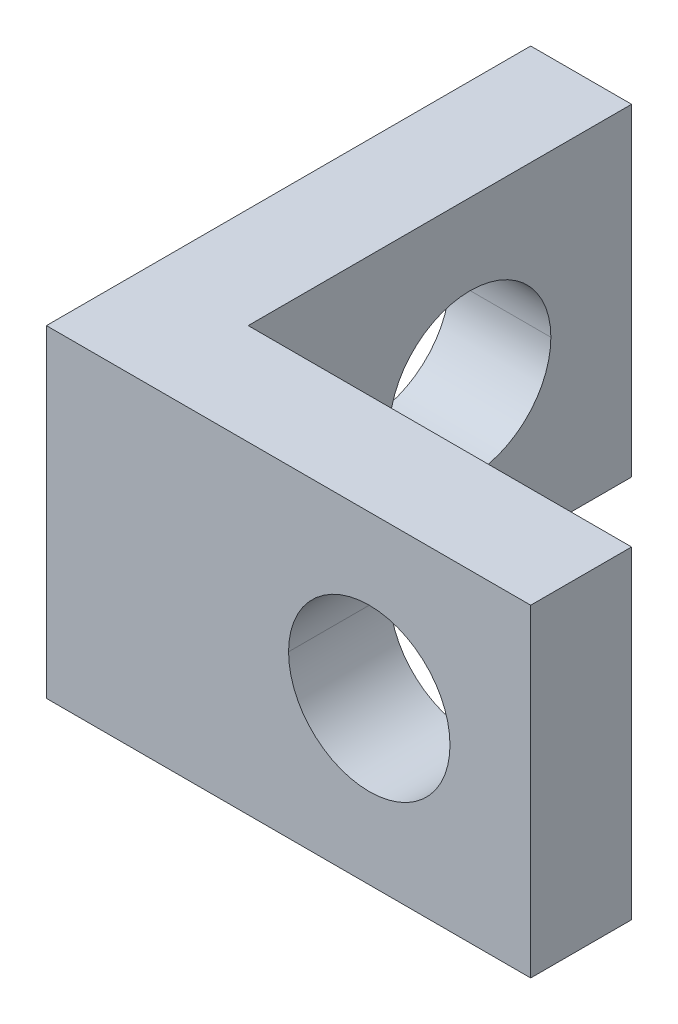
ISO-10303-21;
HEADER;
FILE_DESCRIPTION(('STEP AP214'),'2;1');
FILE_NAME('part.step','',(''),(''),'','','');
FILE_SCHEMA(('AUTOMOTIVE_DESIGN { 1 0 10303 214 1 1 1 1 }'));
ENDSEC;
DATA;
#1=APPLICATION_CONTEXT('core data for automotive mechanical design processes');
#2=APPLICATION_PROTOCOL_DEFINITION('international standard','automotive_design',2000,#1);
#3=PRODUCT_CONTEXT('',#1,'mechanical');
#4=PRODUCT('Part','Part','',(#3));
#5=PRODUCT_RELATED_PRODUCT_CATEGORY('part','',(#4));
#6=PRODUCT_DEFINITION_FORMATION('','',#4);
#7=PRODUCT_DEFINITION_CONTEXT('part definition',#1,'design');
#8=PRODUCT_DEFINITION('design','',#6,#7);
#9=PRODUCT_DEFINITION_SHAPE('','',#8);
#10=(LENGTH_UNIT() NAMED_UNIT(*) SI_UNIT(.MILLI.,.METRE.));
#11=(NAMED_UNIT(*) PLANE_ANGLE_UNIT() SI_UNIT($,.RADIAN.));
#12=(NAMED_UNIT(*) SI_UNIT($,.STERADIAN.) SOLID_ANGLE_UNIT());
#13=UNCERTAINTY_MEASURE_WITH_UNIT(LENGTH_MEASURE(1.E-05),#10,'distance_accuracy_value','');
#14=(GEOMETRIC_REPRESENTATION_CONTEXT(3) GLOBAL_UNCERTAINTY_ASSIGNED_CONTEXT((#13)) GLOBAL_UNIT_ASSIGNED_CONTEXT((#10,
#11,#12)) REPRESENTATION_CONTEXT('',''));
#15=CARTESIAN_POINT('',(0.,0.,0.));
#16=DIRECTION('',(0.,0.,1.));
#17=DIRECTION('',(1.,0.,0.));
#18=AXIS2_PLACEMENT_3D('',#15,#16,#17);
#19=CARTESIAN_POINT('',(8.,4.,-12.));
#20=DIRECTION('',(0.,0.,1.));
#21=DIRECTION('',(1.,0.,0.));
#22=AXIS2_PLACEMENT_3D('',#19,#20,#21);
#23=CYLINDRICAL_SURFACE('',#22,2.);
#24=DIRECTION('',(0.,0.,1.));
#25=VECTOR('',#24,1.);
#26=CARTESIAN_POINT('',(6.,4.,-12.));
#27=LINE('',#26,#25);
#28=CARTESIAN_POINT('',(6.,4.,-2.5));
#29=VERTEX_POINT('',#28);
#30=CARTESIAN_POINT('',(6.,4.,0.));
#31=VERTEX_POINT('',#30);
#32=EDGE_CURVE('E233',#29,#31,#27,.T.);
#33=ORIENTED_EDGE('',*,*,#32,.F.);
#34=CARTESIAN_POINT('',(8.,4.,-2.5));
#35=DIRECTION('',(0.,0.,1.));
#36=DIRECTION('',(-1.,0.,0.));
#37=AXIS2_PLACEMENT_3D('',#34,#35,#36);
#38=CIRCLE('',#37,2.);
#39=CARTESIAN_POINT('',(10.,4.,-2.50000000000004));
#40=VERTEX_POINT('',#39);
#41=EDGE_CURVE('E142',#40,#29,#38,.T.);
#42=ORIENTED_EDGE('',*,*,#41,.F.);
#43=DIRECTION('',(0.,0.,1.));
#44=VECTOR('',#43,1.);
#45=CARTESIAN_POINT('',(10.,4.,-12.));
#46=LINE('',#45,#44);
#47=CARTESIAN_POINT('',(10.,4.,0.));
#48=VERTEX_POINT('',#47);
#49=EDGE_CURVE('E216',#40,#48,#46,.T.);
#50=ORIENTED_EDGE('',*,*,#49,.T.);
#51=CARTESIAN_POINT('',(8.,4.,0.));
#52=DIRECTION('',(0.,0.,-1.));
#53=DIRECTION('',(-1.,0.,0.));
#54=AXIS2_PLACEMENT_3D('',#51,#52,#53);
#55=CIRCLE('',#54,2.);
#56=EDGE_CURVE('E70',#31,#48,#55,.T.);
#57=ORIENTED_EDGE('',*,*,#56,.F.);
#58=EDGE_LOOP('',(#33,#42,#50,#57));
#59=FACE_BOUND('',#58,.T.);
#60=ADVANCED_FACE('F15',(#59),#23,.F.);
#61=CARTESIAN_POINT('',(12.,4.,-8.));
#62=DIRECTION('',(-1.,0.,0.));
#63=DIRECTION('',(0.,0.,1.));
#64=AXIS2_PLACEMENT_3D('',#61,#62,#63);
#65=CYLINDRICAL_SURFACE('',#64,2.);
#66=DIRECTION('',(-1.,0.,0.));
#67=VECTOR('',#66,1.);
#68=CARTESIAN_POINT('',(12.,4.,-10.));
#69=LINE('',#68,#67);
#70=CARTESIAN_POINT('',(2.5,4.,-10.));
#71=VERTEX_POINT('',#70);
#72=CARTESIAN_POINT('',(0.,4.,-10.));
#73=VERTEX_POINT('',#72);
#74=EDGE_CURVE('E215',#71,#73,#69,.T.);
#75=ORIENTED_EDGE('',*,*,#74,.F.);
#76=CARTESIAN_POINT('',(2.5,4.,-8.));
#77=DIRECTION('',(-1.,0.,0.));
#78=DIRECTION('',(0.,0.,1.));
#79=AXIS2_PLACEMENT_3D('',#76,#77,#78);
#80=CIRCLE('',#79,2.);
#81=CARTESIAN_POINT('',(2.5,4.,-6.));
#82=VERTEX_POINT('',#81);
#83=EDGE_CURVE('E171',#82,#71,#80,.T.);
#84=ORIENTED_EDGE('',*,*,#83,.F.);
#85=DIRECTION('',(-1.,0.,0.));
#86=VECTOR('',#85,1.);
#87=CARTESIAN_POINT('',(12.,4.,-6.));
#88=LINE('',#87,#86);
#89=CARTESIAN_POINT('',(0.,4.,-6.));
#90=VERTEX_POINT('',#89);
#91=EDGE_CURVE('E162',#82,#90,#88,.T.);
#92=ORIENTED_EDGE('',*,*,#91,.T.);
#93=CARTESIAN_POINT('',(0.,4.,-8.));
#94=DIRECTION('',(-1.,0.,0.));
#95=DIRECTION('',(0.,0.,1.));
#96=AXIS2_PLACEMENT_3D('',#93,#94,#95);
#97=CIRCLE('',#96,2.);
#98=EDGE_CURVE('E172',#90,#73,#97,.T.);
#99=ORIENTED_EDGE('',*,*,#98,.T.);
#100=EDGE_LOOP('',(#75,#84,#92,#99));
#101=FACE_BOUND('',#100,.T.);
#102=ADVANCED_FACE('F252',(#101),#65,.F.);
#103=CARTESIAN_POINT('',(0.,0.,0.));
#104=DIRECTION('',(0.,1.,0.));
#105=DIRECTION('',(1.,0.,0.));
#106=AXIS2_PLACEMENT_3D('',#103,#104,#105);
#107=PLANE('',#106);
#108=DIRECTION('',(1.,0.,0.));
#109=VECTOR('',#108,1.);
#110=CARTESIAN_POINT('',(0.,0.,-2.5));
#111=LINE('',#110,#109);
#112=CARTESIAN_POINT('',(2.5,0.,-2.5));
#113=VERTEX_POINT('',#112);
#114=CARTESIAN_POINT('',(12.,0.,-2.50000000000005));
#115=VERTEX_POINT('',#114);
#116=EDGE_CURVE('E153',#113,#115,#111,.T.);
#117=ORIENTED_EDGE('',*,*,#116,.T.);
#118=DIRECTION('',(0.,0.,-1.));
#119=VECTOR('',#118,1.);
#120=CARTESIAN_POINT('',(12.,0.,0.));
#121=LINE('',#120,#119);
#122=CARTESIAN_POINT('',(12.,0.,0.));
#123=VERTEX_POINT('',#122);
#124=EDGE_CURVE('E25',#123,#115,#121,.T.);
#125=ORIENTED_EDGE('',*,*,#124,.F.);
#126=DIRECTION('',(1.,0.,0.));
#127=VECTOR('',#126,1.);
#128=CARTESIAN_POINT('',(0.,0.,0.));
#129=LINE('',#128,#127);
#130=CARTESIAN_POINT('',(0.,0.,0.));
#131=VERTEX_POINT('',#130);
#132=EDGE_CURVE('E178',#131,#123,#129,.T.);
#133=ORIENTED_EDGE('',*,*,#132,.F.);
#134=DIRECTION('',(0.,0.,-1.));
#135=VECTOR('',#134,1.);
#136=CARTESIAN_POINT('',(0.,0.,0.));
#137=LINE('',#136,#135);
#138=CARTESIAN_POINT('',(0.,0.,-12.));
#139=VERTEX_POINT('',#138);
#140=EDGE_CURVE('E192',#131,#139,#137,.T.);
#141=ORIENTED_EDGE('',*,*,#140,.T.);
#142=DIRECTION('',(1.,0.,0.));
#143=VECTOR('',#142,1.);
#144=CARTESIAN_POINT('',(0.,0.,-12.));
#145=LINE('',#144,#143);
#146=CARTESIAN_POINT('',(2.5,0.,-12.));
#147=VERTEX_POINT('',#146);
#148=EDGE_CURVE('E168',#139,#147,#145,.T.);
#149=ORIENTED_EDGE('',*,*,#148,.T.);
#150=DIRECTION('',(0.,0.,-1.));
#151=VECTOR('',#150,1.);
#152=CARTESIAN_POINT('',(2.5,0.,0.));
#153=LINE('',#152,#151);
#154=EDGE_CURVE('E183',#113,#147,#153,.T.);
#155=ORIENTED_EDGE('',*,*,#154,.F.);
#156=EDGE_LOOP('',(#117,#125,#133,#141,#149,#155));
#157=FACE_BOUND('',#156,.T.);
#158=ADVANCED_FACE('F260',(#157),#107,.F.);
#159=CARTESIAN_POINT('',(0.,8.,0.));
#160=DIRECTION('',(0.,1.,0.));
#161=DIRECTION('',(1.,0.,0.));
#162=AXIS2_PLACEMENT_3D('',#159,#160,#161);
#163=PLANE('',#162);
#164=DIRECTION('',(1.,0.,0.));
#165=VECTOR('',#164,1.);
#166=CARTESIAN_POINT('',(0.,8.,-2.5));
#167=LINE('',#166,#165);
#168=CARTESIAN_POINT('',(2.5,8.,-2.5));
#169=VERTEX_POINT('',#168);
#170=CARTESIAN_POINT('',(12.,8.,-2.50000000000005));
#171=VERTEX_POINT('',#170);
#172=EDGE_CURVE('E18',#169,#171,#167,.T.);
#173=ORIENTED_EDGE('',*,*,#172,.F.);
#174=DIRECTION('',(0.,0.,-1.));
#175=VECTOR('',#174,1.);
#176=CARTESIAN_POINT('',(2.5,8.,0.));
#177=LINE('',#176,#175);
#178=CARTESIAN_POINT('',(2.5,8.,-12.));
#179=VERTEX_POINT('',#178);
#180=EDGE_CURVE('E219',#169,#179,#177,.T.);
#181=ORIENTED_EDGE('',*,*,#180,.T.);
#182=DIRECTION('',(1.,0.,0.));
#183=VECTOR('',#182,1.);
#184=CARTESIAN_POINT('',(0.,8.,-12.));
#185=LINE('',#184,#183);
#186=CARTESIAN_POINT('',(0.,8.,-12.));
#187=VERTEX_POINT('',#186);
#188=EDGE_CURVE('E166',#187,#179,#185,.T.);
#189=ORIENTED_EDGE('',*,*,#188,.F.);
#190=DIRECTION('',(0.,0.,-1.));
#191=VECTOR('',#190,1.);
#192=CARTESIAN_POINT('',(0.,8.,0.));
#193=LINE('',#192,#191);
#194=CARTESIAN_POINT('',(0.,8.,0.));
#195=VERTEX_POINT('',#194);
#196=EDGE_CURVE('E40',#195,#187,#193,.T.);
#197=ORIENTED_EDGE('',*,*,#196,.F.);
#198=DIRECTION('',(1.,0.,0.));
#199=VECTOR('',#198,1.);
#200=CARTESIAN_POINT('',(0.,8.,0.));
#201=LINE('',#200,#199);
#202=CARTESIAN_POINT('',(12.,8.,0.));
#203=VERTEX_POINT('',#202);
#204=EDGE_CURVE('E130',#195,#203,#201,.T.);
#205=ORIENTED_EDGE('',*,*,#204,.T.);
#206=DIRECTION('',(0.,0.,-1.));
#207=VECTOR('',#206,1.);
#208=CARTESIAN_POINT('',(12.,8.,0.));
#209=LINE('',#208,#207);
#210=EDGE_CURVE('E10',#203,#171,#209,.T.);
#211=ORIENTED_EDGE('',*,*,#210,.T.);
#212=EDGE_LOOP('',(#173,#181,#189,#197,#205,#211));
#213=FACE_BOUND('',#212,.T.);
#214=ADVANCED_FACE('F125',(#213),#163,.T.);
#215=CARTESIAN_POINT('',(12.,8.,0.));
#216=DIRECTION('',(-1.,0.,0.));
#217=DIRECTION('',(0.,1.,0.));
#218=AXIS2_PLACEMENT_3D('',#215,#216,#217);
#219=PLANE('',#218);
#220=ORIENTED_EDGE('',*,*,#124,.T.);
#221=DIRECTION('',(0.,-1.,0.));
#222=VECTOR('',#221,1.);
#223=CARTESIAN_POINT('',(12.,8.,-2.50000000000005));
#224=LINE('',#223,#222);
#225=EDGE_CURVE('E135',#171,#115,#224,.T.);
#226=ORIENTED_EDGE('',*,*,#225,.F.);
#227=ORIENTED_EDGE('',*,*,#210,.F.);
#228=DIRECTION('',(0.,-1.,0.));
#229=VECTOR('',#228,1.);
#230=CARTESIAN_POINT('',(12.,8.,0.));
#231=LINE('',#230,#229);
#232=EDGE_CURVE('E175',#203,#123,#231,.T.);
#233=ORIENTED_EDGE('',*,*,#232,.T.);
#234=EDGE_LOOP('',(#220,#226,#227,#233));
#235=FACE_BOUND('',#234,.T.);
#236=ADVANCED_FACE('F136',(#235),#219,.F.);
#237=CARTESIAN_POINT('',(0.,8.,0.));
#238=DIRECTION('',(-1.,0.,0.));
#239=DIRECTION('',(0.,0.,1.));
#240=AXIS2_PLACEMENT_3D('',#237,#238,#239);
#241=PLANE('',#240);
#242=ORIENTED_EDGE('',*,*,#98,.F.);
#243=CARTESIAN_POINT('',(0.,4.,-8.));
#244=DIRECTION('',(-1.,0.,0.));
#245=DIRECTION('',(0.,0.,1.));
#246=AXIS2_PLACEMENT_3D('',#243,#244,#245);
#247=CIRCLE('',#246,2.);
#248=EDGE_CURVE('E232',#73,#90,#247,.T.);
#249=ORIENTED_EDGE('',*,*,#248,.F.);
#250=EDGE_LOOP('',(#242,#249));
#251=FACE_BOUND('',#250,.T.);
#252=ORIENTED_EDGE('',*,*,#140,.F.);
#253=DIRECTION('',(0.,-1.,0.));
#254=VECTOR('',#253,1.);
#255=CARTESIAN_POINT('',(0.,8.,0.));
#256=LINE('',#255,#254);
#257=EDGE_CURVE('E179',#195,#131,#256,.T.);
#258=ORIENTED_EDGE('',*,*,#257,.F.);
#259=ORIENTED_EDGE('',*,*,#196,.T.);
#260=DIRECTION('',(0.,-1.,0.));
#261=VECTOR('',#260,1.);
#262=CARTESIAN_POINT('',(0.,8.,-12.));
#263=LINE('',#262,#261);
#264=EDGE_CURVE('E170',#187,#139,#263,.T.);
#265=ORIENTED_EDGE('',*,*,#264,.T.);
#266=EDGE_LOOP('',(#252,#258,#259,#265));
#267=FACE_BOUND('',#266,.T.);
#268=ADVANCED_FACE('F254',(#251,#267),#241,.T.);
#269=CARTESIAN_POINT('',(0.,8.,-12.));
#270=DIRECTION('',(0.,0.,-1.));
#271=DIRECTION('',(0.,-1.,0.));
#272=AXIS2_PLACEMENT_3D('',#269,#270,#271);
#273=PLANE('',#272);
#274=ORIENTED_EDGE('',*,*,#148,.F.);
#275=ORIENTED_EDGE('',*,*,#264,.F.);
#276=ORIENTED_EDGE('',*,*,#188,.T.);
#277=DIRECTION('',(0.,-1.,0.));
#278=VECTOR('',#277,1.);
#279=CARTESIAN_POINT('',(2.5,8.,-12.));
#280=LINE('',#279,#278);
#281=EDGE_CURVE('E186',#179,#147,#280,.T.);
#282=ORIENTED_EDGE('',*,*,#281,.T.);
#283=EDGE_LOOP('',(#274,#275,#276,#282));
#284=FACE_BOUND('',#283,.T.);
#285=ADVANCED_FACE('F256',(#284),#273,.T.);
#286=CARTESIAN_POINT('',(2.5,8.,0.));
#287=DIRECTION('',(-1.,0.,0.));
#288=DIRECTION('',(0.,0.,1.));
#289=AXIS2_PLACEMENT_3D('',#286,#287,#288);
#290=PLANE('',#289);
#291=ORIENTED_EDGE('',*,*,#83,.T.);
#292=CARTESIAN_POINT('',(2.5,4.,-8.));
#293=DIRECTION('',(-1.,0.,0.));
#294=DIRECTION('',(0.,0.,1.));
#295=AXIS2_PLACEMENT_3D('',#292,#293,#294);
#296=CIRCLE('',#295,2.);
#297=EDGE_CURVE('E211',#71,#82,#296,.T.);
#298=ORIENTED_EDGE('',*,*,#297,.T.);
#299=EDGE_LOOP('',(#291,#298));
#300=FACE_BOUND('',#299,.T.);
#301=ORIENTED_EDGE('',*,*,#154,.T.);
#302=ORIENTED_EDGE('',*,*,#281,.F.);
#303=ORIENTED_EDGE('',*,*,#180,.F.);
#304=DIRECTION('',(0.,-1.,0.));
#305=VECTOR('',#304,1.);
#306=CARTESIAN_POINT('',(2.5,8.,-2.5));
#307=LINE('',#306,#305);
#308=EDGE_CURVE('E146',#169,#113,#307,.T.);
#309=ORIENTED_EDGE('',*,*,#308,.T.);
#310=EDGE_LOOP('',(#301,#302,#303,#309));
#311=FACE_BOUND('',#310,.T.);
#312=ADVANCED_FACE('F323',(#300,#311),#290,.F.);
#313=CARTESIAN_POINT('',(0.,8.,0.));
#314=DIRECTION('',(0.,0.,-1.));
#315=DIRECTION('',(-1.,0.,0.));
#316=AXIS2_PLACEMENT_3D('',#313,#314,#315);
#317=PLANE('',#316);
#318=CARTESIAN_POINT('',(8.,4.,0.));
#319=DIRECTION('',(0.,0.,-1.));
#320=DIRECTION('',(-1.,0.,0.));
#321=AXIS2_PLACEMENT_3D('',#318,#319,#320);
#322=CIRCLE('',#321,2.);
#323=EDGE_CURVE('E208',#48,#31,#322,.T.);
#324=ORIENTED_EDGE('',*,*,#323,.T.);
#325=ORIENTED_EDGE('',*,*,#56,.T.);
#326=EDGE_LOOP('',(#324,#325));
#327=FACE_BOUND('',#326,.T.);
#328=ORIENTED_EDGE('',*,*,#132,.T.);
#329=ORIENTED_EDGE('',*,*,#232,.F.);
#330=ORIENTED_EDGE('',*,*,#204,.F.);
#331=ORIENTED_EDGE('',*,*,#257,.T.);
#332=EDGE_LOOP('',(#328,#329,#330,#331));
#333=FACE_BOUND('',#332,.T.);
#334=ADVANCED_FACE('F259',(#327,#333),#317,.F.);
#335=CARTESIAN_POINT('',(0.,8.,-2.5));
#336=DIRECTION('',(0.,0.,-1.));
#337=DIRECTION('',(-1.,0.,0.));
#338=AXIS2_PLACEMENT_3D('',#335,#336,#337);
#339=PLANE('',#338);
#340=ORIENTED_EDGE('',*,*,#41,.T.);
#341=CARTESIAN_POINT('',(8.,4.,-2.5));
#342=DIRECTION('',(0.,0.,1.));
#343=DIRECTION('',(-1.,0.,0.));
#344=AXIS2_PLACEMENT_3D('',#341,#342,#343);
#345=CIRCLE('',#344,2.);
#346=EDGE_CURVE('E236',#29,#40,#345,.T.);
#347=ORIENTED_EDGE('',*,*,#346,.T.);
#348=EDGE_LOOP('',(#340,#347));
#349=FACE_BOUND('',#348,.T.);
#350=ORIENTED_EDGE('',*,*,#116,.F.);
#351=ORIENTED_EDGE('',*,*,#308,.F.);
#352=ORIENTED_EDGE('',*,*,#172,.T.);
#353=ORIENTED_EDGE('',*,*,#225,.T.);
#354=EDGE_LOOP('',(#350,#351,#352,#353));
#355=FACE_BOUND('',#354,.T.);
#356=ADVANCED_FACE('F144',(#349,#355),#339,.T.);
#357=CARTESIAN_POINT('',(12.,4.,-8.));
#358=DIRECTION('',(-1.,0.,0.));
#359=DIRECTION('',(0.,0.,1.));
#360=AXIS2_PLACEMENT_3D('',#357,#358,#359);
#361=CYLINDRICAL_SURFACE('',#360,2.);
#362=ORIENTED_EDGE('',*,*,#297,.F.);
#363=ORIENTED_EDGE('',*,*,#74,.T.);
#364=ORIENTED_EDGE('',*,*,#248,.T.);
#365=ORIENTED_EDGE('',*,*,#91,.F.);
#366=EDGE_LOOP('',(#362,#363,#364,#365));
#367=FACE_BOUND('',#366,.T.);
#368=ADVANCED_FACE('F248',(#367),#361,.F.);
#369=CARTESIAN_POINT('',(8.,4.,-12.));
#370=DIRECTION('',(0.,0.,1.));
#371=DIRECTION('',(1.,0.,0.));
#372=AXIS2_PLACEMENT_3D('',#369,#370,#371);
#373=CYLINDRICAL_SURFACE('',#372,2.);
#374=ORIENTED_EDGE('',*,*,#346,.F.);
#375=ORIENTED_EDGE('',*,*,#32,.T.);
#376=ORIENTED_EDGE('',*,*,#323,.F.);
#377=ORIENTED_EDGE('',*,*,#49,.F.);
#378=EDGE_LOOP('',(#374,#375,#376,#377));
#379=FACE_BOUND('',#378,.T.);
#380=ADVANCED_FACE('F353',(#379),#373,.F.);
#381=CLOSED_SHELL('',(#60,#102,#158,#214,#236,#268,#285,#312,#334,#356,#368,#380));
#382=MANIFOLD_SOLID_BREP('B1',#381);
#383=ADVANCED_BREP_SHAPE_REPRESENTATION('',(#18,#382),#14);
#384=SHAPE_DEFINITION_REPRESENTATION(#9,#383);
ENDSEC;
END-ISO-10303-21;
